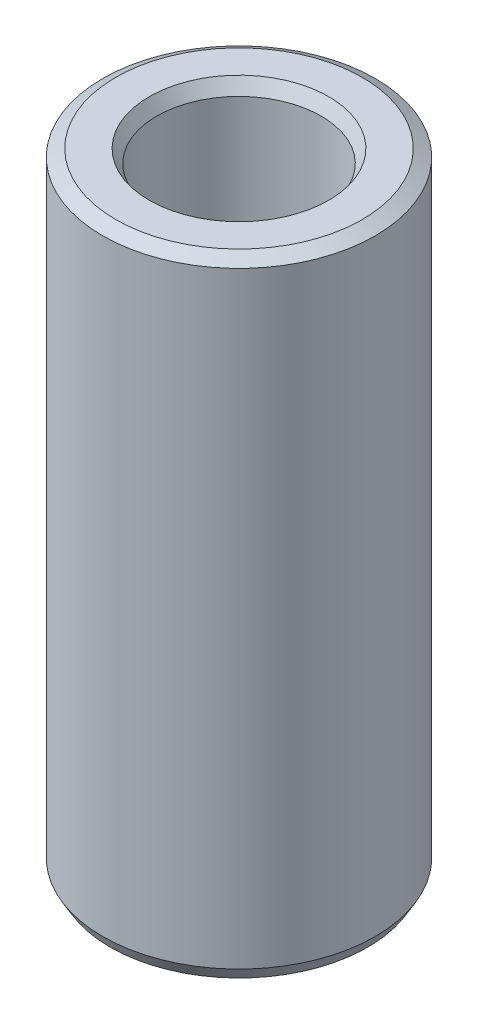
ISO-10303-21;
HEADER;
FILE_DESCRIPTION(('STEP AP214'),'2;1');
FILE_NAME('part.step','',(''),(''),'','','');
FILE_SCHEMA(('AUTOMOTIVE_DESIGN { 1 0 10303 214 1 1 1 1 }'));
ENDSEC;
DATA;
#1=APPLICATION_CONTEXT('core data for automotive mechanical design processes');
#2=APPLICATION_PROTOCOL_DEFINITION('international standard','automotive_design',2000,#1);
#3=PRODUCT_CONTEXT('',#1,'mechanical');
#4=PRODUCT('Part','Part','',(#3));
#5=PRODUCT_RELATED_PRODUCT_CATEGORY('part','',(#4));
#6=PRODUCT_DEFINITION_FORMATION('','',#4);
#7=PRODUCT_DEFINITION_CONTEXT('part definition',#1,'design');
#8=PRODUCT_DEFINITION('design','',#6,#7);
#9=PRODUCT_DEFINITION_SHAPE('','',#8);
#10=(LENGTH_UNIT() NAMED_UNIT(*) SI_UNIT(.MILLI.,.METRE.));
#11=(NAMED_UNIT(*) PLANE_ANGLE_UNIT() SI_UNIT($,.RADIAN.));
#12=(NAMED_UNIT(*) SI_UNIT($,.STERADIAN.) SOLID_ANGLE_UNIT());
#13=UNCERTAINTY_MEASURE_WITH_UNIT(LENGTH_MEASURE(1.E-05),#10,'distance_accuracy_value','');
#14=(GEOMETRIC_REPRESENTATION_CONTEXT(3) GLOBAL_UNCERTAINTY_ASSIGNED_CONTEXT((#13)) GLOBAL_UNIT_ASSIGNED_CONTEXT((#10,
#11,#12)) REPRESENTATION_CONTEXT('',''));
#15=CARTESIAN_POINT('',(0.,0.,0.));
#16=DIRECTION('',(0.,0.,1.));
#17=DIRECTION('',(1.,0.,0.));
#18=AXIS2_PLACEMENT_3D('',#15,#16,#17);
#19=CARTESIAN_POINT('',(0.,230.191908904534,0.));
#20=DIRECTION('',(0.,-1.,0.));
#21=DIRECTION('',(0.,0.,-1.));
#22=AXIS2_PLACEMENT_3D('',#19,#20,#21);
#23=CYLINDRICAL_SURFACE('',#22,50.);
#24=CARTESIAN_POINT('',(0.,4.78778548718703,0.));
#25=DIRECTION('',(0.,1.,0.));
#26=DIRECTION('',(0.,0.,1.));
#27=AXIS2_PLACEMENT_3D('',#24,#25,#26);
#28=CIRCLE('',#27,50.);
#29=CARTESIAN_POINT('',(0.,4.78778548718703,50.));
#30=VERTEX_POINT('',#29);
#31=EDGE_CURVE('E10',#30,#30,#28,.T.);
#32=ORIENTED_EDGE('',*,*,#31,.T.);
#33=EDGE_LOOP('',(#32));
#34=FACE_BOUND('',#33,.T.);
#35=CARTESIAN_POINT('',(0.,227.427679664684,0.));
#36=DIRECTION('',(0.,1.,0.));
#37=DIRECTION('',(0.,0.,1.));
#38=AXIS2_PLACEMENT_3D('',#35,#36,#37);
#39=CIRCLE('',#38,50.);
#40=CARTESIAN_POINT('',(0.,227.427679664684,50.));
#41=VERTEX_POINT('',#40);
#42=EDGE_CURVE('E50',#41,#41,#39,.F.);
#43=ORIENTED_EDGE('',*,*,#42,.T.);
#44=EDGE_LOOP('',(#43));
#45=FACE_BOUND('',#44,.T.);
#46=ADVANCED_FACE('F39',(#34,#45),#23,.T.);
#47=CARTESIAN_POINT('',(0.,230.191908904534,0.));
#48=DIRECTION('',(0.,1.,0.));
#49=DIRECTION('',(0.,0.,1.));
#50=AXIS2_PLACEMENT_3D('',#47,#48,#49);
#51=PLANE('',#50);
#52=CARTESIAN_POINT('',(0.,230.191908904534,0.));
#53=DIRECTION('',(0.,1.,0.));
#54=DIRECTION('',(0.,0.,1.));
#55=AXIS2_PLACEMENT_3D('',#52,#53,#54);
#56=CIRCLE('',#55,32.9383189913694);
#57=CARTESIAN_POINT('',(0.,230.191908904534,32.9383189913694));
#58=VERTEX_POINT('',#57);
#59=EDGE_CURVE('E58',#58,#58,#56,.F.);
#60=ORIENTED_EDGE('',*,*,#59,.T.);
#61=EDGE_LOOP('',(#60));
#62=FACE_BOUND('',#61,.T.);
#63=CARTESIAN_POINT('',(0.,230.191908904534,0.));
#64=DIRECTION('',(0.,1.,0.));
#65=DIRECTION('',(0.,0.,1.));
#66=AXIS2_PLACEMENT_3D('',#63,#64,#65);
#67=CIRCLE('',#66,45.2122145128129);
#68=CARTESIAN_POINT('',(0.,230.191908904534,45.2122145128129));
#69=VERTEX_POINT('',#68);
#70=EDGE_CURVE('E61',#69,#69,#67,.T.);
#71=ORIENTED_EDGE('',*,*,#70,.T.);
#72=EDGE_LOOP('',(#71));
#73=FACE_BOUND('',#72,.T.);
#74=ADVANCED_FACE('F88',(#62,#73),#51,.T.);
#75=CARTESIAN_POINT('',(0.,0.,0.));
#76=DIRECTION('',(0.,1.,0.));
#77=DIRECTION('',(0.,0.,1.));
#78=AXIS2_PLACEMENT_3D('',#75,#76,#77);
#79=PLANE('',#78);
#80=CARTESIAN_POINT('',(0.,0.,0.));
#81=DIRECTION('',(0.,1.,0.));
#82=DIRECTION('',(0.,0.,1.));
#83=AXIS2_PLACEMENT_3D('',#80,#81,#82);
#84=CIRCLE('',#83,34.9618752387069);
#85=CARTESIAN_POINT('',(0.,0.,34.9618752387069));
#86=VERTEX_POINT('',#85);
#87=EDGE_CURVE('E51',#86,#86,#84,.T.);
#88=ORIENTED_EDGE('',*,*,#87,.T.);
#89=EDGE_LOOP('',(#88));
#90=FACE_BOUND('',#89,.T.);
#91=CARTESIAN_POINT('',(0.,0.,0.));
#92=DIRECTION('',(0.,1.,0.));
#93=DIRECTION('',(0.,0.,1.));
#94=AXIS2_PLACEMENT_3D('',#91,#92,#93);
#95=CIRCLE('',#94,47.2357707601504);
#96=CARTESIAN_POINT('',(0.,0.,47.2357707601504));
#97=VERTEX_POINT('',#96);
#98=EDGE_CURVE('E54',#97,#97,#95,.F.);
#99=ORIENTED_EDGE('',*,*,#98,.T.);
#100=EDGE_LOOP('',(#99));
#101=FACE_BOUND('',#100,.T.);
#102=ADVANCED_FACE('F83',(#90,#101),#79,.F.);
#103=CARTESIAN_POINT('',(0.,230.191908904534,0.));
#104=DIRECTION('',(0.,-1.,0.));
#105=DIRECTION('',(0.,0.,-1.));
#106=AXIS2_PLACEMENT_3D('',#103,#104,#105);
#107=CYLINDRICAL_SURFACE('',#106,30.1740897515198);
#108=CARTESIAN_POINT('',(0.,225.404123417347,0.));
#109=DIRECTION('',(0.,1.,0.));
#110=DIRECTION('',(0.,0.,1.));
#111=AXIS2_PLACEMENT_3D('',#108,#109,#110);
#112=CIRCLE('',#111,30.1740897515198);
#113=CARTESIAN_POINT('',(0.,225.404123417347,30.1740897515198));
#114=VERTEX_POINT('',#113);
#115=EDGE_CURVE('E67',#114,#114,#112,.T.);
#116=ORIENTED_EDGE('',*,*,#115,.T.);
#117=EDGE_LOOP('',(#116));
#118=FACE_BOUND('',#117,.T.);
#119=CARTESIAN_POINT('',(0.,2.76422923984965,0.));
#120=DIRECTION('',(0.,1.,0.));
#121=DIRECTION('',(0.,0.,1.));
#122=AXIS2_PLACEMENT_3D('',#119,#120,#121);
#123=CIRCLE('',#122,30.1740897515198);
#124=CARTESIAN_POINT('',(0.,2.76422923984965,30.1740897515198));
#125=VERTEX_POINT('',#124);
#126=EDGE_CURVE('E69',#125,#125,#123,.F.);
#127=ORIENTED_EDGE('',*,*,#126,.T.);
#128=EDGE_LOOP('',(#127));
#129=FACE_BOUND('',#128,.T.);
#130=ADVANCED_FACE('F71',(#118,#129),#107,.F.);
#131=CARTESIAN_POINT('',(0.,225.404123417347,0.));
#132=DIRECTION('',(0.,1.,0.));
#133=DIRECTION('',(0.,0.,1.));
#134=AXIS2_PLACEMENT_3D('',#131,#132,#133);
#135=CONICAL_SURFACE('',#134,30.1740897515198,0.523598775598299);
#136=ORIENTED_EDGE('',*,*,#59,.F.);
#137=EDGE_LOOP('',(#136));
#138=FACE_BOUND('',#137,.T.);
#139=ORIENTED_EDGE('',*,*,#115,.F.);
#140=EDGE_LOOP('',(#139));
#141=FACE_BOUND('',#140,.T.);
#142=ADVANCED_FACE('F77',(#138,#141),#135,.F.);
#143=CARTESIAN_POINT('',(0.,0.,0.));
#144=DIRECTION('',(0.,-1.,0.));
#145=DIRECTION('',(0.,0.,-1.));
#146=AXIS2_PLACEMENT_3D('',#143,#144,#145);
#147=CONICAL_SURFACE('',#146,34.9618752387069,1.04719755119659);
#148=ORIENTED_EDGE('',*,*,#126,.F.);
#149=EDGE_LOOP('',(#148));
#150=FACE_BOUND('',#149,.T.);
#151=ORIENTED_EDGE('',*,*,#87,.F.);
#152=EDGE_LOOP('',(#151));
#153=FACE_BOUND('',#152,.T.);
#154=ADVANCED_FACE('F73',(#150,#153),#147,.F.);
#155=CARTESIAN_POINT('',(0.,4.78778548718703,0.));
#156=DIRECTION('',(0.,1.,0.));
#157=DIRECTION('',(0.,0.,1.));
#158=AXIS2_PLACEMENT_3D('',#155,#156,#157);
#159=CONICAL_SURFACE('',#158,50.,0.523598775598302);
#160=ORIENTED_EDGE('',*,*,#98,.F.);
#161=EDGE_LOOP('',(#160));
#162=FACE_BOUND('',#161,.T.);
#163=ORIENTED_EDGE('',*,*,#31,.F.);
#164=EDGE_LOOP('',(#163));
#165=FACE_BOUND('',#164,.T.);
#166=ADVANCED_FACE('F76',(#162,#165),#159,.T.);
#167=CARTESIAN_POINT('',(0.,230.191908904534,0.));
#168=DIRECTION('',(0.,-1.,0.));
#169=DIRECTION('',(0.,0.,-1.));
#170=AXIS2_PLACEMENT_3D('',#167,#168,#169);
#171=CONICAL_SURFACE('',#170,45.2122145128129,1.0471975511966);
#172=ORIENTED_EDGE('',*,*,#42,.F.);
#173=EDGE_LOOP('',(#172));
#174=FACE_BOUND('',#173,.T.);
#175=ORIENTED_EDGE('',*,*,#70,.F.);
#176=EDGE_LOOP('',(#175));
#177=FACE_BOUND('',#176,.T.);
#178=ADVANCED_FACE('F45',(#174,#177),#171,.T.);
#179=CLOSED_SHELL('',(#46,#74,#102,#130,#142,#154,#166,#178));
#180=MANIFOLD_SOLID_BREP('B2',#179);
#181=ADVANCED_BREP_SHAPE_REPRESENTATION('',(#18,#180),#14);
#182=SHAPE_DEFINITION_REPRESENTATION(#9,#181);
ENDSEC;
END-ISO-10303-21;
